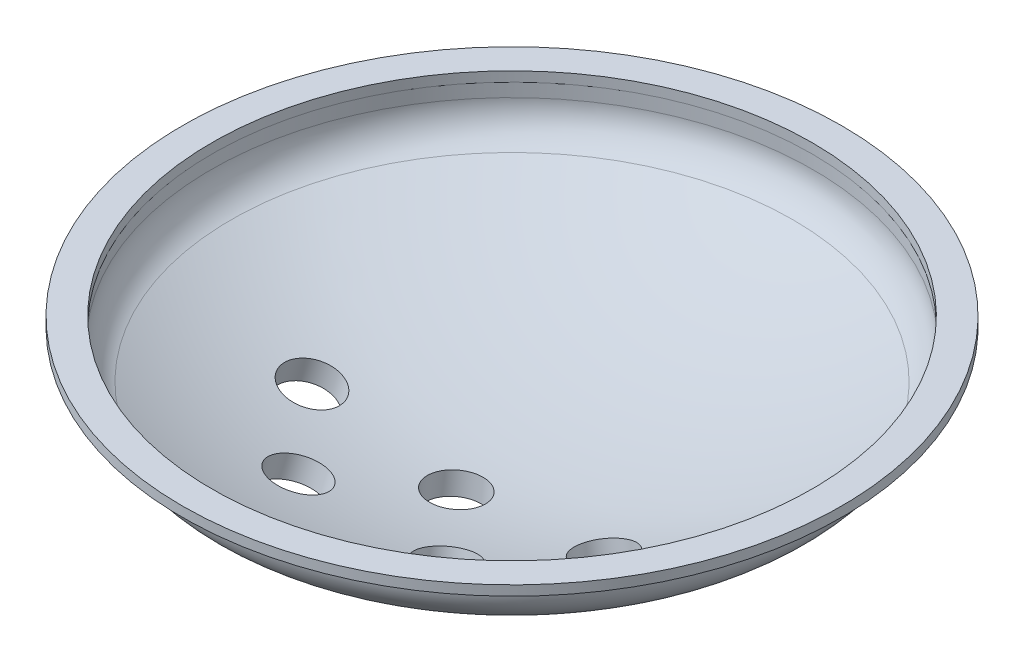
ISO-10303-21;
HEADER;
FILE_DESCRIPTION(('STEP AP214'),'2;1');
FILE_NAME('part.step','',(''),(''),'','','');
FILE_SCHEMA(('AUTOMOTIVE_DESIGN { 1 0 10303 214 1 1 1 1 }'));
ENDSEC;
DATA;
#1=APPLICATION_CONTEXT('core data for automotive mechanical design processes');
#2=APPLICATION_PROTOCOL_DEFINITION('international standard','automotive_design',2000,#1);
#3=PRODUCT_CONTEXT('',#1,'mechanical');
#4=PRODUCT('Part','Part','',(#3));
#5=PRODUCT_RELATED_PRODUCT_CATEGORY('part','',(#4));
#6=PRODUCT_DEFINITION_FORMATION('','',#4);
#7=PRODUCT_DEFINITION_CONTEXT('part definition',#1,'design');
#8=PRODUCT_DEFINITION('design','',#6,#7);
#9=PRODUCT_DEFINITION_SHAPE('','',#8);
#10=(LENGTH_UNIT() NAMED_UNIT(*) SI_UNIT(.MILLI.,.METRE.));
#11=(NAMED_UNIT(*) PLANE_ANGLE_UNIT() SI_UNIT($,.RADIAN.));
#12=(NAMED_UNIT(*) SI_UNIT($,.STERADIAN.) SOLID_ANGLE_UNIT());
#13=UNCERTAINTY_MEASURE_WITH_UNIT(LENGTH_MEASURE(1.E-05),#10,'distance_accuracy_value','');
#14=(GEOMETRIC_REPRESENTATION_CONTEXT(3) GLOBAL_UNCERTAINTY_ASSIGNED_CONTEXT((#13)) GLOBAL_UNIT_ASSIGNED_CONTEXT((#10,
#11,#12)) REPRESENTATION_CONTEXT('',''));
#15=CARTESIAN_POINT('',(0.,0.,0.));
#16=DIRECTION('',(0.,0.,1.));
#17=DIRECTION('',(1.,0.,0.));
#18=AXIS2_PLACEMENT_3D('',#15,#16,#17);
#19=CARTESIAN_POINT('',(123.189590709971,4984.68733573869,-6.10622663543836E-13));
#20=DIRECTION('',(0.,0.,1.));
#21=DIRECTION('',(-0.462382445141056,-0.886680593238274,0.));
#22=AXIS2_PLACEMENT_3D('',#19,#20,#21);
#23=SPHERICAL_SURFACE('',#22,2158.99999999998);
#24=CARTESIAN_POINT('',(123.189590709971,3070.34393493729,-6.10622663543836E-13));
#25=DIRECTION('',(0.,1.,0.));
#26=DIRECTION('',(0.,0.,1.));
#27=AXIS2_PLACEMENT_3D('',#24,#25,#26);
#28=CIRCLE('',#27,998.283699059563);
#29=CARTESIAN_POINT('',(123.189590709971,3070.34393493729,998.283699059562));
#30=VERTEX_POINT('',#29);
#31=EDGE_CURVE('E59',#30,#30,#28,.T.);
#32=ORIENTED_EDGE('',*,*,#31,.T.);
#33=EDGE_LOOP('',(#32));
#34=FACE_BOUND('',#33,.T.);
#35=CARTESIAN_POINT('',(642.076241296446,2899.9839101473,192.293288157969));
#36=DIRECTION('',(-0.240570801667055,0.966528573756726,-0.0891527088599086));
#37=DIRECTION('',(-0.970392707633796,-0.241532591943924,0.));
#38=AXIS2_PLACEMENT_3D('',#35,#36,#37);
#39=CIRCLE('',#38,95.2500000000302);
#40=CARTESIAN_POINT('',(549.646335894297,2876.97793076464,192.293288157969));
#41=VERTEX_POINT('',#40);
#42=EDGE_CURVE('E190',#41,#41,#39,.T.);
#43=ORIENTED_EDGE('',*,*,#42,.F.);
#44=EDGE_LOOP('',(#43));
#45=FACE_BOUND('',#44,.T.);
#46=CARTESIAN_POINT('',(123.189590710002,2836.90702386302,198.111507538424));
#47=DIRECTION('',(0.,0.995772835646627,-0.0918502029843997));
#48=DIRECTION('',(0.,0.0918502029843997,0.995772835646627));
#49=AXIS2_PLACEMENT_3D('',#46,#47,#48);
#50=CIRCLE('',#49,95.2500000000254);
#51=CARTESIAN_POINT('',(123.189590710002,2845.65575569728,292.958870133791));
#52=VERTEX_POINT('',#51);
#53=EDGE_CURVE('E184',#52,#52,#50,.T.);
#54=ORIENTED_EDGE('',*,*,#53,.F.);
#55=EDGE_LOOP('',(#54));
#56=FACE_BOUND('',#55,.T.);
#57=CARTESIAN_POINT('',(386.942223393138,2902.10874472612,495.489049837325));
#58=DIRECTION('',(-0.122283319901547,0.965543439221841,-0.229722999826999));
#59=DIRECTION('',(0.,0.231460053346925,0.972844408785207));
#60=AXIS2_PLACEMENT_3D('',#57,#58,#59);
#61=CIRCLE('',#60,95.2500000000372);
#62=CARTESIAN_POINT('',(386.942223393138,2924.15531480742,588.152479774153));
#63=VERTEX_POINT('',#62);
#64=EDGE_CURVE('E178',#63,#63,#61,.T.);
#65=ORIENTED_EDGE('',*,*,#64,.F.);
#66=EDGE_LOOP('',(#65));
#67=FACE_BOUND('',#66,.T.);
#68=CARTESIAN_POINT('',(-140.56304197313,2902.10874472646,495.4890498388));
#69=DIRECTION('',(0.122283319901546,0.965543439226316,-0.22972299980819));
#70=DIRECTION('',(0.,0.231460053327974,0.972844408789715));
#71=AXIS2_PLACEMENT_3D('',#68,#69,#70);
#72=CIRCLE('',#71,95.2499999999982);
#73=CARTESIAN_POINT('',(-140.56304197313,2924.15531480595,588.152479776018));
#74=VERTEX_POINT('',#73);
#75=EDGE_CURVE('E172',#74,#74,#72,.T.);
#76=ORIENTED_EDGE('',*,*,#75,.F.);
#77=EDGE_LOOP('',(#76));
#78=FACE_BOUND('',#77,.T.);
#79=CARTESIAN_POINT('',(-395.697059876417,2899.98391014729,192.293288158025));
#80=DIRECTION('',(0.240570801667364,0.966528573756694,-0.0891527088594265));
#81=DIRECTION('',(-0.970392707633721,0.241532591944224,0.));
#82=AXIS2_PLACEMENT_3D('',#79,#80,#81);
#83=CIRCLE('',#82,95.2499999999986);
#84=CARTESIAN_POINT('',(-488.126965278528,2922.98988952997,192.293288158025));
#85=VERTEX_POINT('',#84);
#86=EDGE_CURVE('E166',#85,#85,#83,.T.);
#87=ORIENTED_EDGE('',*,*,#86,.F.);
#88=EDGE_LOOP('',(#87));
#89=FACE_BOUND('',#88,.T.);
#90=ADVANCED_FACE('F44',(#34,#45,#56,#67,#78,#89),#23,.F.);
#91=CARTESIAN_POINT('',(123.189590710003,3188.58279204559,3.14120572188845E-13));
#92=DIRECTION('',(0.,1.,0.));
#93=DIRECTION('',(0.,0.,1.));
#94=AXIS2_PLACEMENT_3D('',#91,#92,#93);
#95=CYLINDRICAL_SURFACE('',#94,1069.975);
#96=CARTESIAN_POINT('',(123.189590710003,3188.58279204561,3.14120572188845E-13));
#97=DIRECTION('',(0.,1.,0.));
#98=DIRECTION('',(0.,0.,1.));
#99=AXIS2_PLACEMENT_3D('',#96,#97,#98);
#100=CIRCLE('',#99,1069.975);
#101=CARTESIAN_POINT('',(123.189590710003,3188.58279204561,1069.975));
#102=VERTEX_POINT('',#101);
#103=EDGE_CURVE('E55',#102,#102,#100,.F.);
#104=ORIENTED_EDGE('',*,*,#103,.T.);
#105=EDGE_LOOP('',(#104));
#106=FACE_BOUND('',#105,.T.);
#107=CARTESIAN_POINT('',(123.189590710003,3238.43733573869,3.14120572188845E-13));
#108=DIRECTION('',(0.,1.,0.));
#109=DIRECTION('',(0.,0.,1.));
#110=AXIS2_PLACEMENT_3D('',#107,#108,#109);
#111=CIRCLE('',#110,1069.975);
#112=CARTESIAN_POINT('',(123.189590710003,3238.43733573869,1069.975));
#113=VERTEX_POINT('',#112);
#114=EDGE_CURVE('E70',#113,#113,#111,.T.);
#115=ORIENTED_EDGE('',*,*,#114,.T.);
#116=EDGE_LOOP('',(#115));
#117=FACE_BOUND('',#116,.T.);
#118=ADVANCED_FACE('F235',(#106,#117),#95,.F.);
#119=CARTESIAN_POINT('',(-946.785409289997,3238.43733573869,1069.975));
#120=DIRECTION('',(0.,-1.,0.));
#121=DIRECTION('',(0.,0.,-1.));
#122=AXIS2_PLACEMENT_3D('',#119,#120,#121);
#123=PLANE('',#122);
#124=CARTESIAN_POINT('',(123.189590710003,3238.43733573869,3.11067962640171E-13));
#125=DIRECTION('',(0.,-1.,0.));
#126=DIRECTION('',(0.,0.,-1.));
#127=AXIS2_PLACEMENT_3D('',#124,#125,#126);
#128=CIRCLE('',#127,1066.8);
#129=CARTESIAN_POINT('',(123.189590710003,3238.43733573869,-1066.8));
#130=VERTEX_POINT('',#129);
#131=EDGE_CURVE('E163',#130,#130,#128,.T.);
#132=ORIENTED_EDGE('',*,*,#131,.F.);
#133=EDGE_LOOP('',(#132));
#134=FACE_BOUND('',#133,.T.);
#135=ORIENTED_EDGE('',*,*,#114,.F.);
#136=EDGE_LOOP('',(#135));
#137=FACE_BOUND('',#136,.T.);
#138=ADVANCED_FACE('F232',(#134,#137),#123,.T.);
#139=CARTESIAN_POINT('',(123.189590710003,3238.43733573869,3.11067962640171E-13));
#140=DIRECTION('',(0.,-1.,0.));
#141=DIRECTION('',(0.,0.,-1.));
#142=AXIS2_PLACEMENT_3D('',#139,#140,#141);
#143=CYLINDRICAL_SURFACE('',#142,1066.8);
#144=CARTESIAN_POINT('',(123.189590710003,3273.36233573869,3.11067962640171E-13));
#145=DIRECTION('',(0.,-1.,0.));
#146=DIRECTION('',(0.,0.,-1.));
#147=AXIS2_PLACEMENT_3D('',#144,#145,#146);
#148=CIRCLE('',#147,1066.8);
#149=CARTESIAN_POINT('',(123.189590710003,3273.36233573869,-1066.8));
#150=VERTEX_POINT('',#149);
#151=EDGE_CURVE('E160',#150,#150,#148,.T.);
#152=ORIENTED_EDGE('',*,*,#151,.F.);
#153=EDGE_LOOP('',(#152));
#154=FACE_BOUND('',#153,.T.);
#155=ORIENTED_EDGE('',*,*,#131,.T.);
#156=EDGE_LOOP('',(#155));
#157=FACE_BOUND('',#156,.T.);
#158=ADVANCED_FACE('F234',(#154,#157),#143,.F.);
#159=CARTESIAN_POINT('',(-1048.38540929,3238.43733573869,1171.575));
#160=DIRECTION('',(0.,-1.,0.));
#161=DIRECTION('',(0.,0.,-1.));
#162=AXIS2_PLACEMENT_3D('',#159,#160,#161);
#163=PLANE('',#162);
#164=CARTESIAN_POINT('',(123.189590710003,3238.43733573869,2.55556811408913E-13));
#165=DIRECTION('',(0.,-1.,0.));
#166=DIRECTION('',(0.,0.,-1.));
#167=AXIS2_PLACEMENT_3D('',#164,#165,#166);
#168=CIRCLE('',#167,1079.5);
#169=CARTESIAN_POINT('',(123.189590710003,3238.43733573869,-1079.5));
#170=VERTEX_POINT('',#169);
#171=EDGE_CURVE('E69',#170,#170,#168,.T.);
#172=ORIENTED_EDGE('',*,*,#171,.F.);
#173=EDGE_LOOP('',(#172));
#174=FACE_BOUND('',#173,.T.);
#175=CARTESIAN_POINT('',(123.189590710003,3238.43733573869,2.5341834256355E-13));
#176=DIRECTION('',(0.,-1.,0.));
#177=DIRECTION('',(0.,0.,-1.));
#178=AXIS2_PLACEMENT_3D('',#175,#176,#177);
#179=CIRCLE('',#178,1171.575);
#180=CARTESIAN_POINT('',(123.189590710003,3238.43733573869,-1171.575));
#181=VERTEX_POINT('',#180);
#182=EDGE_CURVE('E65',#181,#181,#179,.F.);
#183=ORIENTED_EDGE('',*,*,#182,.F.);
#184=EDGE_LOOP('',(#183));
#185=FACE_BOUND('',#184,.T.);
#186=ADVANCED_FACE('F242',(#174,#185),#163,.T.);
#187=CARTESIAN_POINT('',(123.189590710003,3273.36233573869,2.5341834256355E-13));
#188=DIRECTION('',(0.,-1.,0.));
#189=DIRECTION('',(0.,0.,-1.));
#190=AXIS2_PLACEMENT_3D('',#187,#188,#189);
#191=CYLINDRICAL_SURFACE('',#190,1171.575);
#192=ORIENTED_EDGE('',*,*,#182,.T.);
#193=EDGE_LOOP('',(#192));
#194=FACE_BOUND('',#193,.T.);
#195=CARTESIAN_POINT('',(123.189590710003,3273.36233573869,2.5341834256355E-13));
#196=DIRECTION('',(0.,1.,0.));
#197=DIRECTION('',(0.,0.,1.));
#198=AXIS2_PLACEMENT_3D('',#195,#196,#197);
#199=CIRCLE('',#198,1171.575);
#200=CARTESIAN_POINT('',(123.189590710003,3273.36233573869,1171.575));
#201=VERTEX_POINT('',#200);
#202=EDGE_CURVE('E74',#201,#201,#199,.T.);
#203=ORIENTED_EDGE('',*,*,#202,.F.);
#204=EDGE_LOOP('',(#203));
#205=FACE_BOUND('',#204,.T.);
#206=ADVANCED_FACE('F253',(#194,#205),#191,.T.);
#207=CARTESIAN_POINT('',(123.189590710003,3238.43733573869,2.55556811408913E-13));
#208=DIRECTION('',(0.,-1.,0.));
#209=DIRECTION('',(0.,0.,-1.));
#210=AXIS2_PLACEMENT_3D('',#207,#208,#209);
#211=CYLINDRICAL_SURFACE('',#210,1079.5);
#212=CARTESIAN_POINT('',(123.189590710003,3188.58279204558,2.55556811408913E-13));
#213=DIRECTION('',(0.,1.,0.));
#214=DIRECTION('',(0.,0.,1.));
#215=AXIS2_PLACEMENT_3D('',#212,#213,#214);
#216=CIRCLE('',#215,1079.5);
#217=CARTESIAN_POINT('',(123.189590710003,3188.58279204558,1079.5));
#218=VERTEX_POINT('',#217);
#219=EDGE_CURVE('E51',#218,#218,#216,.T.);
#220=ORIENTED_EDGE('',*,*,#219,.T.);
#221=EDGE_LOOP('',(#220));
#222=FACE_BOUND('',#221,.T.);
#223=ORIENTED_EDGE('',*,*,#171,.T.);
#224=EDGE_LOOP('',(#223));
#225=FACE_BOUND('',#224,.T.);
#226=ADVANCED_FACE('F258',(#222,#225),#211,.T.);
#227=CARTESIAN_POINT('',(-1048.38540929,3273.36233573869,-1171.575));
#228=DIRECTION('',(0.,1.,0.));
#229=DIRECTION('',(0.,0.,1.));
#230=AXIS2_PLACEMENT_3D('',#227,#228,#229);
#231=PLANE('',#230);
#232=ORIENTED_EDGE('',*,*,#151,.T.);
#233=EDGE_LOOP('',(#232));
#234=FACE_BOUND('',#233,.T.);
#235=ORIENTED_EDGE('',*,*,#202,.T.);
#236=EDGE_LOOP('',(#235));
#237=FACE_BOUND('',#236,.T.);
#238=ADVANCED_FACE('F262',(#234,#237),#231,.T.);
#239=CARTESIAN_POINT('',(634.25343406422,2931.41318861559,189.39424783052));
#240=DIRECTION('',(0.240570801666919,-0.966528573756767,0.0891527088598345));
#241=DIRECTION('',(0.97039270763383,0.241532591943786,0.));
#242=AXIS2_PLACEMENT_3D('',#239,#240,#241);
#243=CYLINDRICAL_SURFACE('',#242,101.6);
#244=CARTESIAN_POINT('',(644.300494187966,2891.04764705957,193.117570111956));
#245=DIRECTION('',(0.240570801666921,-0.966528573756766,0.0891527088598341));
#246=DIRECTION('',(0.97039270763383,0.241532591943789,0.));
#247=AXIS2_PLACEMENT_3D('',#244,#245,#246);
#248=CIRCLE('',#247,101.600000000001);
#249=CARTESIAN_POINT('',(742.892393283564,2915.58735840106,193.117570111956));
#250=VERTEX_POINT('',#249);
#251=EDGE_CURVE('E94',#250,#250,#248,.F.);
#252=ORIENTED_EDGE('',*,*,#251,.F.);
#253=EDGE_LOOP('',(#252));
#254=FACE_BOUND('',#253,.T.);
#255=CARTESIAN_POINT('',(654.802948234311,2848.8524934498,197.009656023546));
#256=DIRECTION('',(0.240570801666919,-0.966528573756767,0.0891527088598345));
#257=DIRECTION('',(0.97039270763383,0.241532591943786,0.));
#258=AXIS2_PLACEMENT_3D('',#255,#256,#257);
#259=CIRCLE('',#258,101.6);
#260=CARTESIAN_POINT('',(753.394847329908,2873.39220479129,197.009656023546));
#261=VERTEX_POINT('',#260);
#262=EDGE_CURVE('E78',#261,#261,#259,.T.);
#263=ORIENTED_EDGE('',*,*,#262,.F.);
#264=EDGE_LOOP('',(#263));
#265=FACE_BOUND('',#264,.T.);
#266=ADVANCED_FACE('F265',(#254,#265),#243,.T.);
#267=CARTESIAN_POINT('',(123.189590709983,2836.95362794309,198.107208772627));
#268=DIRECTION('',(2.50399833409657E-13,-0.995772835646618,0.0918502029844959));
#269=DIRECTION('',(0.,-0.0918502029844959,-0.995772835646618));
#270=AXIS2_PLACEMENT_3D('',#267,#268,#269);
#271=CYLINDRICAL_SURFACE('',#270,101.6);
#272=CARTESIAN_POINT('',(123.189590709988,2827.70037619919,198.960729797221));
#273=DIRECTION('',(2.48091362116441E-13,-0.995772835646618,0.0918502029844961));
#274=DIRECTION('',(0.,-0.0918502029844961,-0.995772835646618));
#275=AXIS2_PLACEMENT_3D('',#272,#273,#274);
#276=CIRCLE('',#275,101.600000000002);
#277=CARTESIAN_POINT('',(123.189590709988,2818.36839557597,97.790209695522));
#278=VERTEX_POINT('',#277);
#279=EDGE_CURVE('E98',#278,#278,#276,.F.);
#280=ORIENTED_EDGE('',*,*,#279,.F.);
#281=EDGE_LOOP('',(#280));
#282=FACE_BOUND('',#281,.T.);
#283=CARTESIAN_POINT('',(123.189590709996,2784.22852352899,202.970578578923));
#284=DIRECTION('',(2.50399833409657E-13,-0.995772835646618,0.0918502029844959));
#285=DIRECTION('',(0.,-0.0918502029844959,-0.995772835646618));
#286=AXIS2_PLACEMENT_3D('',#283,#284,#285);
#287=CIRCLE('',#286,101.6);
#288=CARTESIAN_POINT('',(123.189590709996,2774.89654290577,101.800058477227));
#289=VERTEX_POINT('',#288);
#290=EDGE_CURVE('E82',#289,#289,#287,.T.);
#291=ORIENTED_EDGE('',*,*,#290,.F.);
#292=EDGE_LOOP('',(#291));
#293=FACE_BOUND('',#292,.T.);
#294=ADVANCED_FACE('F269',(#282,#293),#271,.T.);
#295=CARTESIAN_POINT('',(383.362360952111,2930.37517301766,488.763874731007));
#296=DIRECTION('',(0.122283319901395,-0.965543439221844,0.229722999827065));
#297=DIRECTION('',(0.,-0.231460053346988,-0.972844408785192));
#298=AXIS2_PLACEMENT_3D('',#295,#296,#297);
#299=CYLINDRICAL_SURFACE('',#298,101.599999999998);
#300=CARTESIAN_POINT('',(388.072822061038,2893.18158992649,497.613006872489));
#301=DIRECTION('',(0.122283319901634,-0.965543439221872,0.22972299982682));
#302=DIRECTION('',(0.,-0.231460053346748,-0.972844408785249));
#303=AXIS2_PLACEMENT_3D('',#300,#301,#302);
#304=CIRCLE('',#303,101.599999999999);
#305=CARTESIAN_POINT('',(388.072822061038,2869.66524850646,398.772014939909));
#306=VERTEX_POINT('',#305);
#307=EDGE_CURVE('E102',#306,#306,#304,.F.);
#308=ORIENTED_EDGE('',*,*,#307,.F.);
#309=EDGE_LOOP('',(#308));
#310=FACE_BOUND('',#309,.T.);
#311=CARTESIAN_POINT('',(393.411271028973,2851.02944374021,507.64188499202));
#312=DIRECTION('',(0.122283319901395,-0.965543439221844,0.229722999827065));
#313=DIRECTION('',(0.,-0.231460053346988,-0.972844408785192));
#314=AXIS2_PLACEMENT_3D('',#311,#312,#313);
#315=CIRCLE('',#314,101.599999999998);
#316=CARTESIAN_POINT('',(393.411271028973,2827.51310232016,408.800893059446));
#317=VERTEX_POINT('',#316);
#318=EDGE_CURVE('E86',#317,#317,#315,.T.);
#319=ORIENTED_EDGE('',*,*,#318,.F.);
#320=EDGE_LOOP('',(#319));
#321=FACE_BOUND('',#320,.T.);
#322=ADVANCED_FACE('F229',(#310,#321),#299,.T.);
#323=CARTESIAN_POINT('',(-135.794059076628,2939.76441314641,486.529977923665));
#324=DIRECTION('',(-0.122283319901577,-0.965543439226361,0.229722999807985));
#325=DIRECTION('',(0.,-0.231460053327768,-0.972844408789764));
#326=AXIS2_PLACEMENT_3D('',#323,#324,#325);
#327=CYLINDRICAL_SURFACE('',#326,101.599999999997);
#328=CARTESIAN_POINT('',(-141.69364064112,2893.18158992606,497.613006873968));
#329=DIRECTION('',(-0.122283319901587,-0.965543439226306,0.229722999808211));
#330=DIRECTION('',(0.,-0.231460053327997,-0.97284440878971));
#331=AXIS2_PLACEMENT_3D('',#328,#329,#330);
#332=CIRCLE('',#331,101.6);
#333=CARTESIAN_POINT('',(-141.69364064112,2869.66524850794,398.772014940933));
#334=VERTEX_POINT('',#333);
#335=EDGE_CURVE('E106',#334,#334,#332,.F.);
#336=ORIENTED_EDGE('',*,*,#335,.F.);
#337=EDGE_LOOP('',(#336));
#338=FACE_BOUND('',#337,.T.);
#339=CARTESIAN_POINT('',(-147.032089608986,2851.0294437403,507.641884992469));
#340=DIRECTION('',(-0.122283319901577,-0.965543439226361,0.229722999807985));
#341=DIRECTION('',(0.,-0.231460053327768,-0.972844408789764));
#342=AXIS2_PLACEMENT_3D('',#339,#340,#341);
#343=CIRCLE('',#342,101.599999999997);
#344=CARTESIAN_POINT('',(-147.032089608986,2827.5131023222,408.800893059432));
#345=VERTEX_POINT('',#344);
#346=EDGE_CURVE('E90',#345,#345,#343,.T.);
#347=ORIENTED_EDGE('',*,*,#346,.F.);
#348=EDGE_LOOP('',(#347));
#349=FACE_BOUND('',#348,.T.);
#350=ADVANCED_FACE('F219',(#338,#349),#327,.T.);
#351=CARTESIAN_POINT('',(525.849269815854,2804.94527782937,68.9699268646273));
#352=DIRECTION('',(-0.240570801667055,0.966528573756726,-0.0891527088599067));
#353=DIRECTION('',(0.,0.0918502030020758,0.995772835644997));
#354=AXIS2_PLACEMENT_3D('',#351,#352,#353);
#355=PLANE('',#354);
#356=ORIENTED_EDGE('',*,*,#262,.T.);
#357=EDGE_LOOP('',(#356));
#358=FACE_BOUND('',#357,.T.);
#359=CARTESIAN_POINT('',(654.802948234325,2848.85249344981,197.009656023547));
#360=DIRECTION('',(0.240570801667064,-0.96652857375673,0.0891527088598376));
#361=DIRECTION('',(0.970392707633794,0.241532591943931,0.));
#362=AXIS2_PLACEMENT_3D('',#359,#360,#361);
#363=CIRCLE('',#362,127.000000000002);
#364=CARTESIAN_POINT('',(778.042822103818,2879.52713262669,197.009656023547));
#365=VERTEX_POINT('',#364);
#366=EDGE_CURVE('E110',#365,#365,#363,.T.);
#367=ORIENTED_EDGE('',*,*,#366,.F.);
#368=EDGE_LOOP('',(#367));
#369=FACE_BOUND('',#368,.T.);
#370=ADVANCED_FACE('F216',(#358,#369),#355,.T.);
#371=CARTESIAN_POINT('',(-7.11260615348967,2772.26032657671,73.2201258906603));
#372=DIRECTION('',(-1.99650923385128E-13,0.995772835646636,-0.0918502029842975));
#373=DIRECTION('',(0.,0.0918502029842975,0.995772835646636));
#374=AXIS2_PLACEMENT_3D('',#371,#372,#373);
#375=PLANE('',#374);
#376=ORIENTED_EDGE('',*,*,#290,.T.);
#377=EDGE_LOOP('',(#376));
#378=FACE_BOUND('',#377,.T.);
#379=CARTESIAN_POINT('',(123.189590709996,2784.22852352898,202.970578578919));
#380=DIRECTION('',(2.03962440064784E-13,-0.995772835646627,0.0918502029844014));
#381=DIRECTION('',(0.,-0.0918502029844014,-0.995772835646627));
#382=AXIS2_PLACEMENT_3D('',#379,#380,#381);
#383=CIRCLE('',#382,127.000000000001);
#384=CARTESIAN_POINT('',(123.189590709996,2772.56354774996,76.5074284517968));
#385=VERTEX_POINT('',#384);
#386=EDGE_CURVE('E114',#385,#385,#383,.T.);
#387=ORIENTED_EDGE('',*,*,#386,.F.);
#388=EDGE_LOOP('',(#387));
#389=FACE_BOUND('',#388,.T.);
#390=ADVANCED_FACE('F218',(#378,#389),#375,.T.);
#391=CARTESIAN_POINT('',(261.874705072639,2805.06809669743,384.480733767789));
#392=DIRECTION('',(-0.122283319901548,0.96554343922184,-0.229722999827));
#393=DIRECTION('',(0.,0.231460053346926,0.972844408785207));
#394=AXIS2_PLACEMENT_3D('',#391,#392,#393);
#395=PLANE('',#394);
#396=ORIENTED_EDGE('',*,*,#318,.T.);
#397=EDGE_LOOP('',(#396));
#398=FACE_BOUND('',#397,.T.);
#399=CARTESIAN_POINT('',(393.411271028996,2851.02944374021,507.641884992009));
#400=DIRECTION('',(0.122283319901632,-0.965543439221859,0.229722999826878));
#401=DIRECTION('',(0.,-0.231460053346805,-0.972844408785235));
#402=AXIS2_PLACEMENT_3D('',#399,#400,#401);
#403=CIRCLE('',#402,126.999999999999);
#404=CARTESIAN_POINT('',(393.411271028996,2821.63401696517,384.090645076285));
#405=VERTEX_POINT('',#404);
#406=EDGE_CURVE('E118',#405,#405,#403,.T.);
#407=ORIENTED_EDGE('',*,*,#406,.F.);
#408=EDGE_LOOP('',(#407));
#409=FACE_BOUND('',#408,.T.);
#410=ADVANCED_FACE('F226',(#398,#409),#395,.T.);
#411=CARTESIAN_POINT('',(-278.568655564831,2836.6006162298,376.978487173777));
#412=DIRECTION('',(0.122283319901546,0.965543439226294,-0.229722999808284));
#413=DIRECTION('',(0.,0.231460053328069,0.972844408789693));
#414=AXIS2_PLACEMENT_3D('',#411,#412,#413);
#415=PLANE('',#414);
#416=ORIENTED_EDGE('',*,*,#346,.T.);
#417=EDGE_LOOP('',(#416));
#418=FACE_BOUND('',#417,.T.);
#419=CARTESIAN_POINT('',(-147.032089608982,2851.02944374036,507.641884992482));
#420=DIRECTION('',(-0.122283319901679,-0.965543439226294,0.229722999808209));
#421=DIRECTION('',(0.,-0.231460053327997,-0.97284440878971));
#422=AXIS2_PLACEMENT_3D('',#419,#420,#421);
#423=CIRCLE('',#422,127.000000000005);
#424=CARTESIAN_POINT('',(-147.032089608982,2821.6340169677,384.090645076184));
#425=VERTEX_POINT('',#424);
#426=EDGE_CURVE('E122',#425,#425,#423,.T.);
#427=ORIENTED_EDGE('',*,*,#426,.F.);
#428=EDGE_LOOP('',(#427));
#429=FACE_BOUND('',#428,.T.);
#430=ADVANCED_FACE('F284',(#418,#429),#415,.T.);
#431=CARTESIAN_POINT('',(123.189590709999,4984.68733573869,-5.55111512312578E-13));
#432=DIRECTION('',(0.,0.,-1.));
#433=DIRECTION('',(0.462382445141067,-0.886680593238269,0.));
#434=AXIS2_PLACEMENT_3D('',#431,#432,#433);
#435=SPHERICAL_SURFACE('',#434,2168.52500000001);
#436=CARTESIAN_POINT('',(123.189590709999,3061.89830228667,-5.55111512312578E-13));
#437=DIRECTION('',(0.,1.,0.));
#438=DIRECTION('',(0.,0.,1.));
#439=AXIS2_PLACEMENT_3D('',#436,#437,#438);
#440=CIRCLE('',#439,1002.68789184953);
#441=CARTESIAN_POINT('',(123.189590709999,3061.89830228667,1002.68789184953));
#442=VERTEX_POINT('',#441);
#443=EDGE_CURVE('E12',#442,#442,#440,.F.);
#444=ORIENTED_EDGE('',*,*,#443,.T.);
#445=EDGE_LOOP('',(#444));
#446=FACE_BOUND('',#445,.T.);
#447=CARTESIAN_POINT('',(-397.921312768124,2891.04764705888,193.117570112066));
#448=DIRECTION('',(-0.240570801667407,-0.966528573756669,0.0891527088595751));
#449=DIRECTION('',(0.97039270763371,-0.24153259194427,0.));
#450=AXIS2_PLACEMENT_3D('',#447,#448,#449);
#451=CIRCLE('',#450,101.599999999998);
#452=CARTESIAN_POINT('',(-299.329413672541,2866.50793571734,193.117570112066));
#453=VERTEX_POINT('',#452);
#454=EDGE_CURVE('E126',#453,#453,#451,.T.);
#455=ORIENTED_EDGE('',*,*,#454,.F.);
#456=EDGE_LOOP('',(#455));
#457=FACE_BOUND('',#456,.T.);
#458=ORIENTED_EDGE('',*,*,#335,.T.);
#459=EDGE_LOOP('',(#458));
#460=FACE_BOUND('',#459,.T.);
#461=ORIENTED_EDGE('',*,*,#307,.T.);
#462=EDGE_LOOP('',(#461));
#463=FACE_BOUND('',#462,.T.);
#464=ORIENTED_EDGE('',*,*,#279,.T.);
#465=EDGE_LOOP('',(#464));
#466=FACE_BOUND('',#465,.T.);
#467=ORIENTED_EDGE('',*,*,#251,.T.);
#468=EDGE_LOOP('',(#467));
#469=FACE_BOUND('',#468,.T.);
#470=ADVANCED_FACE('F212',(#446,#457,#460,#463,#466,#469),#435,.T.);
#471=CARTESIAN_POINT('',(644.513807071849,2890.19063117906,193.196621357164));
#472=DIRECTION('',(0.240570801667064,-0.96652857375673,0.0891527088598376));
#473=DIRECTION('',(0.970392707633794,0.241532591943931,0.));
#474=AXIS2_PLACEMENT_3D('',#471,#472,#473);
#475=CYLINDRICAL_SURFACE('',#474,127.000000000002);
#476=CARTESIAN_POINT('',(660.913446596669,2824.30266767638,199.274134828587));
#477=DIRECTION('',(0.240570801667055,-0.966528573756726,0.0891527088599086));
#478=DIRECTION('',(0.970392707633796,0.241532591943924,0.));
#479=AXIS2_PLACEMENT_3D('',#476,#477,#478);
#480=CIRCLE('',#479,127.000000000002);
#481=CARTESIAN_POINT('',(784.153320466163,2854.97730685326,199.274134828587));
#482=VERTEX_POINT('',#481);
#483=EDGE_CURVE('E130',#482,#482,#480,.T.);
#484=ORIENTED_EDGE('',*,*,#483,.F.);
#485=EDGE_LOOP('',(#484));
#486=FACE_BOUND('',#485,.T.);
#487=ORIENTED_EDGE('',*,*,#366,.T.);
#488=EDGE_LOOP('',(#487));
#489=FACE_BOUND('',#488,.T.);
#490=ADVANCED_FACE('F208',(#486,#489),#475,.T.);
#491=CARTESIAN_POINT('',(123.189590709991,2807.36165288883,200.836776017427));
#492=DIRECTION('',(2.03962440064784E-13,-0.995772835646627,0.0918502029844014));
#493=DIRECTION('',(0.,-0.0918502029844014,-0.995772835646627));
#494=AXIS2_PLACEMENT_3D('',#491,#492,#493);
#495=CYLINDRICAL_SURFACE('',#494,127.000000000001);
#496=CARTESIAN_POINT('',(123.189590710001,2758.93589350358,205.303573734721));
#497=DIRECTION('',(2.03962440064784E-13,-0.995772835646627,0.0918502029844014));
#498=DIRECTION('',(0.,-0.0918502029844014,-0.995772835646627));
#499=AXIS2_PLACEMENT_3D('',#496,#497,#498);
#500=CIRCLE('',#499,127.000000000001);
#501=CARTESIAN_POINT('',(123.189590710001,2747.27091772456,78.8404236075991));
#502=VERTEX_POINT('',#501);
#503=EDGE_CURVE('E134',#502,#502,#500,.T.);
#504=ORIENTED_EDGE('',*,*,#503,.F.);
#505=EDGE_LOOP('',(#504));
#506=FACE_BOUND('',#505,.T.);
#507=ORIENTED_EDGE('',*,*,#386,.T.);
#508=EDGE_LOOP('',(#507));
#509=FACE_BOUND('',#508,.T.);
#510=ADVANCED_FACE('F211',(#506,#509),#495,.T.);
#511=CARTESIAN_POINT('',(387.52319464285,2897.52142260416,496.580469815162));
#512=DIRECTION('',(0.122283319901632,-0.965543439221859,0.229722999826878));
#513=DIRECTION('',(0.,-0.231460053346805,-0.972844408785235));
#514=AXIS2_PLACEMENT_3D('',#511,#512,#513);
#515=CYLINDRICAL_SURFACE('',#514,126.999999999999);
#516=ORIENTED_EDGE('',*,*,#406,.T.);
#517=EDGE_LOOP('',(#516));
#518=FACE_BOUND('',#517,.T.);
#519=CARTESIAN_POINT('',(396.517267354472,2826.504640384,513.476849187609));
#520=DIRECTION('',(0.122283319901436,-0.965543439221881,0.229722999826887));
#521=DIRECTION('',(0.,-0.23146005334681,-0.972844408785234));
#522=AXIS2_PLACEMENT_3D('',#519,#520,#521);
#523=CIRCLE('',#522,126.999999999993);
#524=CARTESIAN_POINT('',(396.517267354472,2797.10921360895,389.925609271891));
#525=VERTEX_POINT('',#524);
#526=EDGE_CURVE('E138',#525,#525,#523,.T.);
#527=ORIENTED_EDGE('',*,*,#526,.F.);
#528=EDGE_LOOP('',(#527));
#529=FACE_BOUND('',#528,.T.);
#530=ADVANCED_FACE('F288',(#518,#529),#515,.T.);
#531=CARTESIAN_POINT('',(-138.205856194991,2920.7209746279,491.06081066035));
#532=DIRECTION('',(-0.122283319901679,-0.965543439226294,0.229722999808209));
#533=DIRECTION('',(0.,-0.231460053327997,-0.97284440878971));
#534=AXIS2_PLACEMENT_3D('',#531,#532,#533);
#535=CYLINDRICAL_SURFACE('',#534,127.000000000005);
#536=CARTESIAN_POINT('',(-150.138085934485,2826.504640384,513.476849187612));
#537=DIRECTION('',(-0.122283319901679,-0.965543439226294,0.229722999808209));
#538=DIRECTION('',(0.,-0.231460053327997,-0.97284440878971));
#539=AXIS2_PLACEMENT_3D('',#536,#537,#538);
#540=CIRCLE('',#539,127.000000000005);
#541=CARTESIAN_POINT('',(-150.138085934485,2797.10921361135,389.925609271313));
#542=VERTEX_POINT('',#541);
#543=EDGE_CURVE('E142',#542,#542,#540,.T.);
#544=ORIENTED_EDGE('',*,*,#543,.F.);
#545=EDGE_LOOP('',(#544));
#546=FACE_BOUND('',#545,.T.);
#547=ORIENTED_EDGE('',*,*,#426,.T.);
#548=EDGE_LOOP('',(#547));
#549=FACE_BOUND('',#548,.T.);
#550=ADVANCED_FACE('F291',(#546,#549),#535,.T.);
#551=CARTESIAN_POINT('',(-384.384384043389,2945.43424893524,188.100943584307));
#552=DIRECTION('',(-0.240570801667407,-0.966528573756669,0.0891527088595751));
#553=DIRECTION('',(0.97039270763371,-0.24153259194427,0.));
#554=AXIS2_PLACEMENT_3D('',#551,#552,#553);
#555=CYLINDRICAL_SURFACE('',#554,101.599999999998);
#556=CARTESIAN_POINT('',(-408.423766814286,2848.85249344983,197.009656023551));
#557=DIRECTION('',(-0.240570801667161,-0.966528573756751,0.0891527088593493));
#558=DIRECTION('',(0.970392707633772,-0.241532591944019,0.));
#559=AXIS2_PLACEMENT_3D('',#556,#557,#558);
#560=CIRCLE('',#559,101.600000000001);
#561=CARTESIAN_POINT('',(-309.831867718694,2824.31278210831,197.009656023551));
#562=VERTEX_POINT('',#561);
#563=EDGE_CURVE('E146',#562,#562,#560,.T.);
#564=ORIENTED_EDGE('',*,*,#563,.F.);
#565=EDGE_LOOP('',(#564));
#566=FACE_BOUND('',#565,.T.);
#567=ORIENTED_EDGE('',*,*,#454,.T.);
#568=EDGE_LOOP('',(#567));
#569=FACE_BOUND('',#568,.T.);
#570=ADVANCED_FACE('F204',(#566,#569),#555,.T.);
#571=CARTESIAN_POINT('',(534.488271676599,2804.94497219264,330.559431977441));
#572=DIRECTION('',(0.240570801667055,-0.966528573756726,0.0891527088599086));
#573=DIRECTION('',(0.,-0.0918502030020777,-0.995772835644996));
#574=AXIS2_PLACEMENT_3D('',#571,#572,#573);
#575=PLANE('',#574);
#576=CARTESIAN_POINT('',(660.913446596669,2824.30266767638,199.274134828587));
#577=DIRECTION('',(0.240570801667055,-0.966528573756726,0.0891527088599086));
#578=DIRECTION('',(0.970392707633796,0.241532591943924,0.));
#579=AXIS2_PLACEMENT_3D('',#576,#577,#578);
#580=CIRCLE('',#579,95.2500000000302);
#581=CARTESIAN_POINT('',(753.343351998818,2847.30864705905,199.274134828587));
#582=VERTEX_POINT('',#581);
#583=EDGE_CURVE('E193',#582,#582,#580,.T.);
#584=ORIENTED_EDGE('',*,*,#583,.F.);
#585=EDGE_LOOP('',(#584));
#586=FACE_BOUND('',#585,.T.);
#587=ORIENTED_EDGE('',*,*,#483,.T.);
#588=EDGE_LOOP('',(#587));
#589=FACE_BOUND('',#588,.T.);
#590=ADVANCED_FACE('F200',(#586,#589),#575,.T.);
#591=CARTESIAN_POINT('',(-3.81040929000309,2770.60086928256,331.766723861845));
#592=DIRECTION('',(2.02060858742568E-13,-0.995772835646627,0.0918502029843997));
#593=DIRECTION('',(0.,-0.0918502029843997,-0.995772835646627));
#594=AXIS2_PLACEMENT_3D('',#591,#592,#593);
#595=PLANE('',#594);
#596=CARTESIAN_POINT('',(123.189590710002,2758.93589350356,205.303573734715));
#597=DIRECTION('',(0.,-0.995772835646627,0.0918502029843997));
#598=DIRECTION('',(0.,-0.0918502029843997,-0.995772835646627));
#599=AXIS2_PLACEMENT_3D('',#596,#597,#598);
#600=CIRCLE('',#599,95.2500000000255);
#601=CARTESIAN_POINT('',(123.189590710002,2750.1871616693,110.456211139349));
#602=VERTEX_POINT('',#601);
#603=EDGE_CURVE('E187',#602,#602,#600,.T.);
#604=ORIENTED_EDGE('',*,*,#603,.F.);
#605=EDGE_LOOP('',(#604));
#606=FACE_BOUND('',#605,.T.);
#607=ORIENTED_EDGE('',*,*,#503,.T.);
#608=EDGE_LOOP('',(#607));
#609=FACE_BOUND('',#608,.T.);
#610=ADVANCED_FACE('F203',(#606,#609),#595,.T.);
#611=CARTESIAN_POINT('',(264.980701398137,2840.34140736214,641.651771035057));
#612=DIRECTION('',(0.122283319901546,-0.965543439221841,0.229722999826998));
#613=DIRECTION('',(0.,-0.231460053346925,-0.972844408785207));
#614=AXIS2_PLACEMENT_3D('',#611,#612,#613);
#615=PLANE('',#614);
#616=CARTESIAN_POINT('',(396.517267354485,2826.50464038399,513.476849187611));
#617=DIRECTION('',(0.122283319901547,-0.965543439221841,0.229722999826999));
#618=DIRECTION('',(0.,-0.231460053346925,-0.972844408785207));
#619=AXIS2_PLACEMENT_3D('',#616,#617,#618);
#620=CIRCLE('',#619,95.2500000000373);
#621=CARTESIAN_POINT('',(396.517267354485,2804.45807030268,420.813419250784));
#622=VERTEX_POINT('',#621);
#623=EDGE_CURVE('E181',#622,#622,#620,.T.);
#624=ORIENTED_EDGE('',*,*,#623,.F.);
#625=EDGE_LOOP('',(#624));
#626=FACE_BOUND('',#625,.T.);
#627=ORIENTED_EDGE('',*,*,#526,.T.);
#628=EDGE_LOOP('',(#627));
#629=FACE_BOUND('',#628,.T.);
#630=ADVANCED_FACE('F295',(#626,#629),#615,.T.);
#631=CARTESIAN_POINT('',(-281.674651890332,2871.8739268895,634.149524441714));
#632=DIRECTION('',(-0.122283319901546,-0.965543439226316,0.22972299980819));
#633=DIRECTION('',(0.,-0.231460053327974,-0.972844408789715));
#634=AXIS2_PLACEMENT_3D('',#631,#632,#633);
#635=PLANE('',#634);
#636=CARTESIAN_POINT('',(-150.138085934475,2826.50464038398,513.476849187611));
#637=DIRECTION('',(-0.122283319901546,-0.965543439226316,0.22972299980819));
#638=DIRECTION('',(0.,-0.231460053327974,-0.972844408789716));
#639=AXIS2_PLACEMENT_3D('',#636,#637,#638);
#640=CIRCLE('',#639,95.2499999999982);
#641=CARTESIAN_POINT('',(-150.138085934475,2804.4580703045,420.813419250393));
#642=VERTEX_POINT('',#641);
#643=EDGE_CURVE('E175',#642,#642,#640,.T.);
#644=ORIENTED_EDGE('',*,*,#643,.F.);
#645=EDGE_LOOP('',(#644));
#646=FACE_BOUND('',#645,.T.);
#647=ORIENTED_EDGE('',*,*,#543,.T.);
#648=EDGE_LOOP('',(#647));
#649=FACE_BOUND('',#648,.T.);
#650=ADVANCED_FACE('F297',(#646,#649),#635,.T.);
#651=CARTESIAN_POINT('',(-537.377445232757,2868.59734284333,63.0986529317397));
#652=DIRECTION('',(0.240570801667368,0.966528573756693,-0.0891527088594206));
#653=DIRECTION('',(0.,0.0918502030015823,0.995772835645042));
#654=AXIS2_PLACEMENT_3D('',#651,#652,#653);
#655=PLANE('',#654);
#656=ORIENTED_EDGE('',*,*,#563,.T.);
#657=EDGE_LOOP('',(#656));
#658=FACE_BOUND('',#657,.T.);
#659=CARTESIAN_POINT('',(-408.423766814314,2848.85249344982,197.009656023562));
#660=DIRECTION('',(-0.240570801667443,-0.966528573756673,0.089152708859434));
#661=DIRECTION('',(0.970392707633701,-0.241532591944304,0.));
#662=AXIS2_PLACEMENT_3D('',#659,#660,#661);
#663=CIRCLE('',#662,126.999999999998);
#664=CARTESIAN_POINT('',(-285.183892944835,2818.1778542729,197.009656023562));
#665=VERTEX_POINT('',#664);
#666=EDGE_CURVE('E150',#665,#665,#663,.T.);
#667=ORIENTED_EDGE('',*,*,#666,.F.);
#668=EDGE_LOOP('',(#667));
#669=FACE_BOUND('',#668,.T.);
#670=ADVANCED_FACE('F304',(#658,#669),#655,.T.);
#671=CARTESIAN_POINT('',(-393.653250886573,2908.19521332413,191.535876591136));
#672=DIRECTION('',(-0.240570801667443,-0.966528573756673,0.089152708859434));
#673=DIRECTION('',(0.970392707633701,-0.241532591944304,0.));
#674=AXIS2_PLACEMENT_3D('',#671,#672,#673);
#675=CYLINDRICAL_SURFACE('',#674,126.999999999998);
#676=ORIENTED_EDGE('',*,*,#666,.T.);
#677=EDGE_LOOP('',(#676));
#678=FACE_BOUND('',#677,.T.);
#679=CARTESIAN_POINT('',(-414.534265176668,2824.3026676764,199.274134828593));
#680=DIRECTION('',(-0.240570801667445,-0.966528573756672,0.0891527088594378));
#681=DIRECTION('',(0.970392707633701,-0.241532591944306,0.));
#682=AXIS2_PLACEMENT_3D('',#679,#680,#681);
#683=CIRCLE('',#682,127.);
#684=CARTESIAN_POINT('',(-291.294391307188,2793.62802849947,199.274134828593));
#685=VERTEX_POINT('',#684);
#686=EDGE_CURVE('E64',#685,#685,#683,.T.);
#687=ORIENTED_EDGE('',*,*,#686,.F.);
#688=EDGE_LOOP('',(#687));
#689=FACE_BOUND('',#688,.T.);
#690=ADVANCED_FACE('F312',(#678,#689),#675,.T.);
#691=CARTESIAN_POINT('',(-540.959440096708,2867.34895750032,324.803281062837));
#692=DIRECTION('',(-0.240570801667364,-0.966528573756693,0.0891527088594264));
#693=DIRECTION('',(0.,-0.0918502030015883,-0.995772835645042));
#694=AXIS2_PLACEMENT_3D('',#691,#692,#693);
#695=PLANE('',#694);
#696=CARTESIAN_POINT('',(-414.534265176662,2824.30266767639,199.274134828603));
#697=DIRECTION('',(-0.240570801667364,-0.966528573756693,0.0891527088594265));
#698=DIRECTION('',(0.970392707633721,-0.241532591944224,0.));
#699=AXIS2_PLACEMENT_3D('',#696,#697,#698);
#700=CIRCLE('',#699,95.2499999999986);
#701=CARTESIAN_POINT('',(-322.104359774551,2801.2966882937,199.274134828603));
#702=VERTEX_POINT('',#701);
#703=EDGE_CURVE('E169',#702,#702,#700,.T.);
#704=ORIENTED_EDGE('',*,*,#703,.F.);
#705=EDGE_LOOP('',(#704));
#706=FACE_BOUND('',#705,.T.);
#707=ORIENTED_EDGE('',*,*,#686,.T.);
#708=EDGE_LOOP('',(#707));
#709=FACE_BOUND('',#708,.T.);
#710=ADVANCED_FACE('F46',(#706,#709),#695,.T.);
#711=CARTESIAN_POINT('',(-414.534265176662,2824.30266767639,199.274134828603));
#712=DIRECTION('',(-0.240570801667364,-0.966528573756693,0.0891527088594265));
#713=DIRECTION('',(0.970392707633721,-0.241532591944224,0.));
#714=AXIS2_PLACEMENT_3D('',#711,#712,#713);
#715=CYLINDRICAL_SURFACE('',#714,95.2499999999986);
#716=ORIENTED_EDGE('',*,*,#703,.T.);
#717=EDGE_LOOP('',(#716));
#718=FACE_BOUND('',#717,.T.);
#719=ORIENTED_EDGE('',*,*,#86,.T.);
#720=EDGE_LOOP('',(#719));
#721=FACE_BOUND('',#720,.T.);
#722=ADVANCED_FACE('F255',(#718,#721),#715,.F.);
#723=CARTESIAN_POINT('',(-150.138085934475,2826.50464038398,513.476849187611));
#724=DIRECTION('',(-0.122283319901546,-0.965543439226316,0.22972299980819));
#725=DIRECTION('',(0.,-0.231460053327974,-0.972844408789716));
#726=AXIS2_PLACEMENT_3D('',#723,#724,#725);
#727=CYLINDRICAL_SURFACE('',#726,95.2499999999982);
#728=ORIENTED_EDGE('',*,*,#643,.T.);
#729=EDGE_LOOP('',(#728));
#730=FACE_BOUND('',#729,.T.);
#731=ORIENTED_EDGE('',*,*,#75,.T.);
#732=EDGE_LOOP('',(#731));
#733=FACE_BOUND('',#732,.T.);
#734=ADVANCED_FACE('F328',(#730,#733),#727,.F.);
#735=CARTESIAN_POINT('',(396.517267354485,2826.50464038399,513.476849187611));
#736=DIRECTION('',(0.122283319901547,-0.965543439221841,0.229722999826999));
#737=DIRECTION('',(0.,-0.231460053346925,-0.972844408785207));
#738=AXIS2_PLACEMENT_3D('',#735,#736,#737);
#739=CYLINDRICAL_SURFACE('',#738,95.2500000000372);
#740=ORIENTED_EDGE('',*,*,#623,.T.);
#741=EDGE_LOOP('',(#740));
#742=FACE_BOUND('',#741,.T.);
#743=ORIENTED_EDGE('',*,*,#64,.T.);
#744=EDGE_LOOP('',(#743));
#745=FACE_BOUND('',#744,.T.);
#746=ADVANCED_FACE('F343',(#742,#745),#739,.F.);
#747=CARTESIAN_POINT('',(123.189590710002,2758.93589350356,205.303573734715));
#748=DIRECTION('',(0.,-0.995772835646627,0.0918502029843997));
#749=DIRECTION('',(0.,-0.0918502029843997,-0.995772835646627));
#750=AXIS2_PLACEMENT_3D('',#747,#748,#749);
#751=CYLINDRICAL_SURFACE('',#750,95.2500000000254);
#752=ORIENTED_EDGE('',*,*,#603,.T.);
#753=EDGE_LOOP('',(#752));
#754=FACE_BOUND('',#753,.T.);
#755=ORIENTED_EDGE('',*,*,#53,.T.);
#756=EDGE_LOOP('',(#755));
#757=FACE_BOUND('',#756,.T.);
#758=ADVANCED_FACE('F347',(#754,#757),#751,.F.);
#759=CARTESIAN_POINT('',(660.913446596669,2824.30266767638,199.274134828587));
#760=DIRECTION('',(0.240570801667055,-0.966528573756726,0.0891527088599086));
#761=DIRECTION('',(0.970392707633796,0.241532591943924,0.));
#762=AXIS2_PLACEMENT_3D('',#759,#760,#761);
#763=CYLINDRICAL_SURFACE('',#762,95.2500000000302);
#764=ORIENTED_EDGE('',*,*,#583,.T.);
#765=EDGE_LOOP('',(#764));
#766=FACE_BOUND('',#765,.T.);
#767=ORIENTED_EDGE('',*,*,#42,.T.);
#768=EDGE_LOOP('',(#767));
#769=FACE_BOUND('',#768,.T.);
#770=ADVANCED_FACE('F197',(#766,#769),#763,.F.);
#771=CARTESIAN_POINT('',(123.189590710003,3188.58279204561,3.14120572188845E-13));
#772=DIRECTION('',(0.,1.,0.));
#773=DIRECTION('',(0.,0.,1.));
#774=AXIS2_PLACEMENT_3D('',#771,#772,#773);
#775=TOROIDAL_SURFACE('',#774,936.625,133.35);
#776=ORIENTED_EDGE('',*,*,#103,.F.);
#777=EDGE_LOOP('',(#776));
#778=FACE_BOUND('',#777,.T.);
#779=ORIENTED_EDGE('',*,*,#31,.F.);
#780=EDGE_LOOP('',(#779));
#781=FACE_BOUND('',#780,.T.);
#782=ADVANCED_FACE('F354',(#778,#781),#775,.F.);
#783=CARTESIAN_POINT('',(123.189590710003,3188.58279204558,2.55556811408913E-13));
#784=DIRECTION('',(0.,1.,0.));
#785=DIRECTION('',(0.,0.,1.));
#786=AXIS2_PLACEMENT_3D('',#783,#784,#785);
#787=TOROIDAL_SURFACE('',#786,936.625000000001,142.874999999998);
#788=ORIENTED_EDGE('',*,*,#443,.F.);
#789=EDGE_LOOP('',(#788));
#790=FACE_BOUND('',#789,.T.);
#791=ORIENTED_EDGE('',*,*,#219,.F.);
#792=EDGE_LOOP('',(#791));
#793=FACE_BOUND('',#792,.T.);
#794=ADVANCED_FACE('F357',(#790,#793),#787,.T.);
#795=CLOSED_SHELL('',(#90,#118,#138,#158,#186,#206,#226,#238,#266,#294,#322,#350,#370,#390,#410,
#430,#470,#490,#510,#530,#550,#570,#590,#610,#630,#650,#670,#690,#710,#722,#734,#746,#758,#770,
#782,#794));
#796=MANIFOLD_SOLID_BREP('B2',#795);
#797=ADVANCED_BREP_SHAPE_REPRESENTATION('',(#18,#796),#14);
#798=SHAPE_DEFINITION_REPRESENTATION(#9,#797);
ENDSEC;
END-ISO-10303-21;
